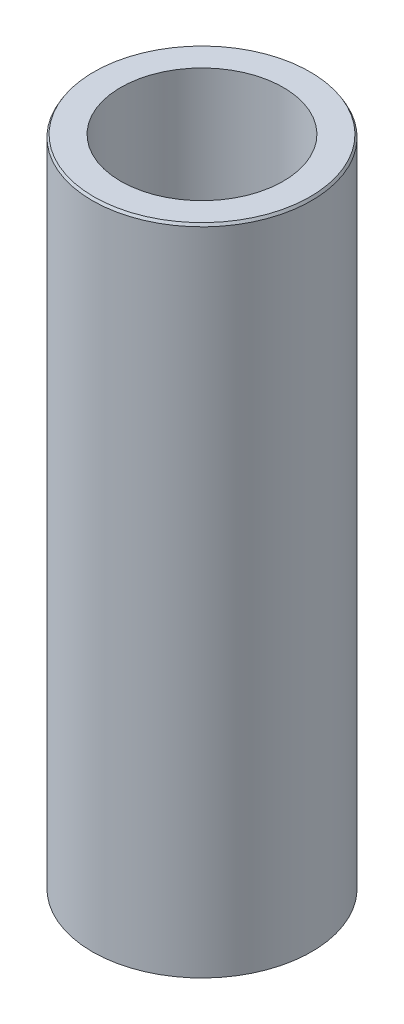
ISO-10303-21;
HEADER;
FILE_DESCRIPTION(('STEP AP214'),'2;1');
FILE_NAME('part.step','',(''),(''),'','','');
FILE_SCHEMA(('AUTOMOTIVE_DESIGN { 1 0 10303 214 1 1 1 1 }'));
ENDSEC;
DATA;
#1=APPLICATION_CONTEXT('core data for automotive mechanical design processes');
#2=APPLICATION_PROTOCOL_DEFINITION('international standard','automotive_design',2000,#1);
#3=PRODUCT_CONTEXT('',#1,'mechanical');
#4=PRODUCT('Part','Part','',(#3));
#5=PRODUCT_RELATED_PRODUCT_CATEGORY('part','',(#4));
#6=PRODUCT_DEFINITION_FORMATION('','',#4);
#7=PRODUCT_DEFINITION_CONTEXT('part definition',#1,'design');
#8=PRODUCT_DEFINITION('design','',#6,#7);
#9=PRODUCT_DEFINITION_SHAPE('','',#8);
#10=(LENGTH_UNIT() NAMED_UNIT(*) SI_UNIT(.MILLI.,.METRE.));
#11=(NAMED_UNIT(*) PLANE_ANGLE_UNIT() SI_UNIT($,.RADIAN.));
#12=(NAMED_UNIT(*) SI_UNIT($,.STERADIAN.) SOLID_ANGLE_UNIT());
#13=UNCERTAINTY_MEASURE_WITH_UNIT(LENGTH_MEASURE(1.E-05),#10,'distance_accuracy_value','');
#14=(GEOMETRIC_REPRESENTATION_CONTEXT(3) GLOBAL_UNCERTAINTY_ASSIGNED_CONTEXT((#13)) GLOBAL_UNIT_ASSIGNED_CONTEXT((#10,
#11,#12)) REPRESENTATION_CONTEXT('',''));
#15=CARTESIAN_POINT('',(0.,0.,0.));
#16=DIRECTION('',(0.,0.,1.));
#17=DIRECTION('',(1.,0.,0.));
#18=AXIS2_PLACEMENT_3D('',#15,#16,#17);
#19=CARTESIAN_POINT('',(0.,238.748994060245,0.));
#20=DIRECTION('',(0.,-1.,0.));
#21=DIRECTION('',(0.,0.,-1.));
#22=AXIS2_PLACEMENT_3D('',#19,#20,#21);
#23=CYLINDRICAL_SURFACE('',#22,40.);
#24=CARTESIAN_POINT('',(0.,237.801861315341,0.));
#25=DIRECTION('',(0.,1.,0.));
#26=DIRECTION('',(0.,0.,1.));
#27=AXIS2_PLACEMENT_3D('',#24,#25,#26);
#28=CIRCLE('',#27,40.);
#29=CARTESIAN_POINT('',(0.,237.801861315341,40.));
#30=VERTEX_POINT('',#29);
#31=EDGE_CURVE('E50',#30,#30,#28,.F.);
#32=ORIENTED_EDGE('',*,*,#31,.T.);
#33=EDGE_LOOP('',(#32));
#34=FACE_BOUND('',#33,.T.);
#35=CARTESIAN_POINT('',(0.,0.546827345228817,0.));
#36=DIRECTION('',(0.,1.,0.));
#37=DIRECTION('',(0.,0.,1.));
#38=AXIS2_PLACEMENT_3D('',#35,#36,#37);
#39=CIRCLE('',#38,40.);
#40=CARTESIAN_POINT('',(0.,0.546827345228817,40.));
#41=VERTEX_POINT('',#40);
#42=EDGE_CURVE('E51',#41,#41,#39,.T.);
#43=ORIENTED_EDGE('',*,*,#42,.T.);
#44=EDGE_LOOP('',(#43));
#45=FACE_BOUND('',#44,.T.);
#46=ADVANCED_FACE('F39',(#34,#45),#23,.T.);
#47=CARTESIAN_POINT('',(0.,238.748994060245,0.));
#48=DIRECTION('',(0.,1.,0.));
#49=DIRECTION('',(0.,0.,1.));
#50=AXIS2_PLACEMENT_3D('',#47,#48,#49);
#51=PLANE('',#50);
#52=CARTESIAN_POINT('',(0.,238.748994060245,0.));
#53=DIRECTION('',(0.,1.,0.));
#54=DIRECTION('',(0.,0.,1.));
#55=AXIS2_PLACEMENT_3D('',#52,#53,#54);
#56=CIRCLE('',#55,39.4531726547712);
#57=CARTESIAN_POINT('',(0.,238.748994060245,39.4531726547712));
#58=VERTEX_POINT('',#57);
#59=EDGE_CURVE('E54',#58,#58,#56,.T.);
#60=ORIENTED_EDGE('',*,*,#59,.T.);
#61=EDGE_LOOP('',(#60));
#62=FACE_BOUND('',#61,.T.);
#63=CARTESIAN_POINT('',(0.,238.748994060245,0.));
#64=DIRECTION('',(0.,1.,0.));
#65=DIRECTION('',(0.,0.,1.));
#66=AXIS2_PLACEMENT_3D('',#63,#64,#65);
#67=CIRCLE('',#66,29.6516957578506);
#68=CARTESIAN_POINT('',(0.,238.748994060245,29.6516957578506));
#69=VERTEX_POINT('',#68);
#70=EDGE_CURVE('E58',#69,#69,#67,.T.);
#71=ORIENTED_EDGE('',*,*,#70,.F.);
#72=EDGE_LOOP('',(#71));
#73=FACE_BOUND('',#72,.T.);
#74=ADVANCED_FACE('F69',(#62,#73),#51,.T.);
#75=CARTESIAN_POINT('',(0.,0.,0.));
#76=DIRECTION('',(0.,1.,0.));
#77=DIRECTION('',(0.,0.,1.));
#78=AXIS2_PLACEMENT_3D('',#75,#76,#77);
#79=PLANE('',#78);
#80=CARTESIAN_POINT('',(0.,0.,0.));
#81=DIRECTION('',(0.,1.,0.));
#82=DIRECTION('',(0.,0.,1.));
#83=AXIS2_PLACEMENT_3D('',#80,#81,#82);
#84=CIRCLE('',#83,39.0528672550957);
#85=CARTESIAN_POINT('',(0.,0.,39.0528672550957));
#86=VERTEX_POINT('',#85);
#87=EDGE_CURVE('E10',#86,#86,#84,.F.);
#88=ORIENTED_EDGE('',*,*,#87,.T.);
#89=EDGE_LOOP('',(#88));
#90=FACE_BOUND('',#89,.T.);
#91=CARTESIAN_POINT('',(0.,0.,0.));
#92=DIRECTION('',(0.,1.,0.));
#93=DIRECTION('',(0.,0.,1.));
#94=AXIS2_PLACEMENT_3D('',#91,#92,#93);
#95=CIRCLE('',#94,29.6516957578506);
#96=CARTESIAN_POINT('',(0.,0.,29.6516957578506));
#97=VERTEX_POINT('',#96);
#98=EDGE_CURVE('E63',#97,#97,#95,.T.);
#99=ORIENTED_EDGE('',*,*,#98,.T.);
#100=EDGE_LOOP('',(#99));
#101=FACE_BOUND('',#100,.T.);
#102=ADVANCED_FACE('F75',(#90,#101),#79,.F.);
#103=CARTESIAN_POINT('',(0.,238.748994060245,0.));
#104=DIRECTION('',(0.,-1.,0.));
#105=DIRECTION('',(0.,0.,-1.));
#106=AXIS2_PLACEMENT_3D('',#103,#104,#105);
#107=CYLINDRICAL_SURFACE('',#106,29.6516957578506);
#108=ORIENTED_EDGE('',*,*,#70,.T.);
#109=EDGE_LOOP('',(#108));
#110=FACE_BOUND('',#109,.T.);
#111=ORIENTED_EDGE('',*,*,#98,.F.);
#112=EDGE_LOOP('',(#111));
#113=FACE_BOUND('',#112,.T.);
#114=ADVANCED_FACE('F70',(#110,#113),#107,.F.);
#115=CARTESIAN_POINT('',(0.,238.748994060245,0.));
#116=DIRECTION('',(0.,-1.,0.));
#117=DIRECTION('',(0.,0.,-1.));
#118=AXIS2_PLACEMENT_3D('',#115,#116,#117);
#119=CONICAL_SURFACE('',#118,39.4531726547712,0.523598775598288);
#120=ORIENTED_EDGE('',*,*,#31,.F.);
#121=EDGE_LOOP('',(#120));
#122=FACE_BOUND('',#121,.T.);
#123=ORIENTED_EDGE('',*,*,#59,.F.);
#124=EDGE_LOOP('',(#123));
#125=FACE_BOUND('',#124,.T.);
#126=ADVANCED_FACE('F81',(#122,#125),#119,.T.);
#127=CARTESIAN_POINT('',(0.,0.546827345228817,0.));
#128=DIRECTION('',(0.,1.,0.));
#129=DIRECTION('',(0.,0.,1.));
#130=AXIS2_PLACEMENT_3D('',#127,#128,#129);
#131=CONICAL_SURFACE('',#130,40.,1.04719755119661);
#132=ORIENTED_EDGE('',*,*,#87,.F.);
#133=EDGE_LOOP('',(#132));
#134=FACE_BOUND('',#133,.T.);
#135=ORIENTED_EDGE('',*,*,#42,.F.);
#136=EDGE_LOOP('',(#135));
#137=FACE_BOUND('',#136,.T.);
#138=ADVANCED_FACE('F45',(#134,#137),#131,.T.);
#139=CLOSED_SHELL('',(#46,#74,#102,#114,#126,#138));
#140=MANIFOLD_SOLID_BREP('B2',#139);
#141=ADVANCED_BREP_SHAPE_REPRESENTATION('',(#18,#140),#14);
#142=SHAPE_DEFINITION_REPRESENTATION(#9,#141);
ENDSEC;
END-ISO-10303-21;
